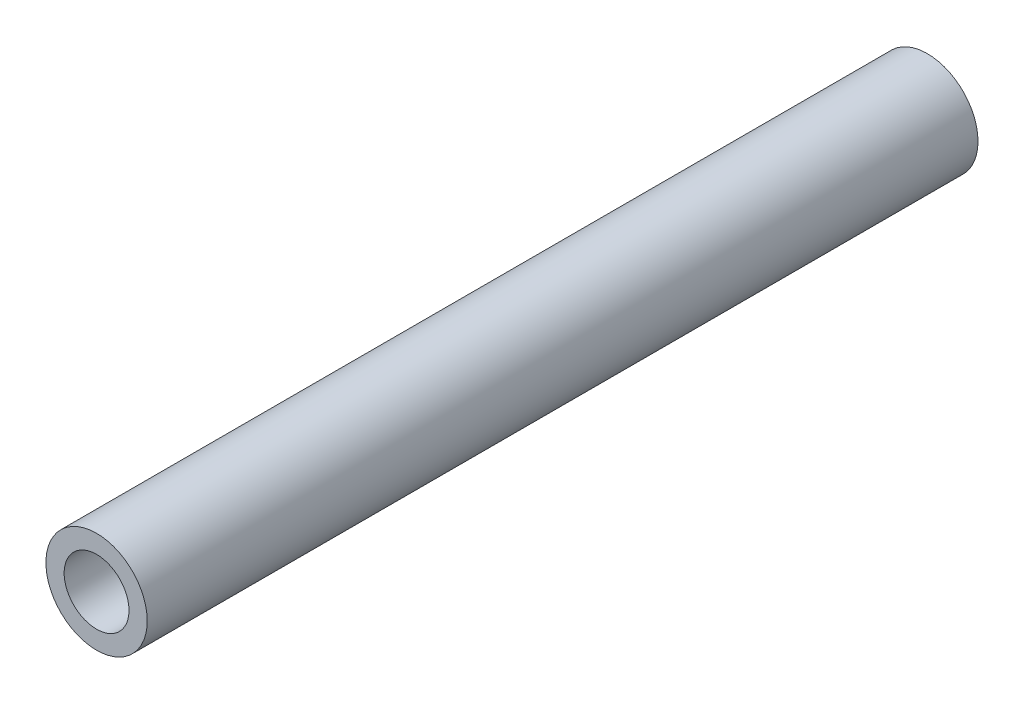
ISO-10303-21;
HEADER;
FILE_DESCRIPTION(('STEP AP214'),'2;1');
FILE_NAME('part.step','',(''),(''),'','','');
FILE_SCHEMA(('AUTOMOTIVE_DESIGN { 1 0 10303 214 1 1 1 1 }'));
ENDSEC;
DATA;
#1=APPLICATION_CONTEXT('core data for automotive mechanical design processes');
#2=APPLICATION_PROTOCOL_DEFINITION('international standard','automotive_design',2000,#1);
#3=PRODUCT_CONTEXT('',#1,'mechanical');
#4=PRODUCT('Part','Part','',(#3));
#5=PRODUCT_RELATED_PRODUCT_CATEGORY('part','',(#4));
#6=PRODUCT_DEFINITION_FORMATION('','',#4);
#7=PRODUCT_DEFINITION_CONTEXT('part definition',#1,'design');
#8=PRODUCT_DEFINITION('design','',#6,#7);
#9=PRODUCT_DEFINITION_SHAPE('','',#8);
#10=(LENGTH_UNIT() NAMED_UNIT(*) SI_UNIT(.MILLI.,.METRE.));
#11=(NAMED_UNIT(*) PLANE_ANGLE_UNIT() SI_UNIT($,.RADIAN.));
#12=(NAMED_UNIT(*) SI_UNIT($,.STERADIAN.) SOLID_ANGLE_UNIT());
#13=UNCERTAINTY_MEASURE_WITH_UNIT(LENGTH_MEASURE(1.E-05),#10,'distance_accuracy_value','');
#14=(GEOMETRIC_REPRESENTATION_CONTEXT(3) GLOBAL_UNCERTAINTY_ASSIGNED_CONTEXT((#13)) GLOBAL_UNIT_ASSIGNED_CONTEXT((#10,
#11,#12)) REPRESENTATION_CONTEXT('',''));
#15=CARTESIAN_POINT('',(0.,0.,0.));
#16=DIRECTION('',(0.,0.,1.));
#17=DIRECTION('',(1.,0.,0.));
#18=AXIS2_PLACEMENT_3D('',#15,#16,#17);
#19=CARTESIAN_POINT('',(0.,0.,41.));
#20=DIRECTION('',(0.,0.,1.));
#21=DIRECTION('',(1.,0.,0.));
#22=AXIS2_PLACEMENT_3D('',#19,#20,#21);
#23=PLANE('',#22);
#24=CARTESIAN_POINT('',(0.,0.,41.));
#25=DIRECTION('',(0.,0.,1.));
#26=DIRECTION('',(1.,0.,0.));
#27=AXIS2_PLACEMENT_3D('',#24,#25,#26);
#28=CIRCLE('',#27,2.5);
#29=CARTESIAN_POINT('',(2.5,0.,41.));
#30=VERTEX_POINT('',#29);
#31=EDGE_CURVE('E10',#30,#30,#28,.T.);
#32=ORIENTED_EDGE('',*,*,#31,.T.);
#33=EDGE_LOOP('',(#32));
#34=FACE_BOUND('',#33,.T.);
#35=CARTESIAN_POINT('',(0.,0.,41.));
#36=DIRECTION('',(0.,0.,1.));
#37=DIRECTION('',(1.,0.,0.));
#38=AXIS2_PLACEMENT_3D('',#35,#36,#37);
#39=CIRCLE('',#38,1.6);
#40=CARTESIAN_POINT('',(1.6,0.,41.));
#41=VERTEX_POINT('',#40);
#42=EDGE_CURVE('E42',#41,#41,#39,.T.);
#43=ORIENTED_EDGE('',*,*,#42,.F.);
#44=EDGE_LOOP('',(#43));
#45=FACE_BOUND('',#44,.T.);
#46=ADVANCED_FACE('F31',(#34,#45),#23,.T.);
#47=CARTESIAN_POINT('',(0.,0.,0.));
#48=DIRECTION('',(0.,0.,1.));
#49=DIRECTION('',(1.,0.,0.));
#50=AXIS2_PLACEMENT_3D('',#47,#48,#49);
#51=PLANE('',#50);
#52=CARTESIAN_POINT('',(0.,0.,0.));
#53=DIRECTION('',(0.,0.,1.));
#54=DIRECTION('',(1.,0.,0.));
#55=AXIS2_PLACEMENT_3D('',#52,#53,#54);
#56=CIRCLE('',#55,2.5);
#57=CARTESIAN_POINT('',(2.5,0.,0.));
#58=VERTEX_POINT('',#57);
#59=EDGE_CURVE('E35',#58,#58,#56,.T.);
#60=ORIENTED_EDGE('',*,*,#59,.F.);
#61=EDGE_LOOP('',(#60));
#62=FACE_BOUND('',#61,.T.);
#63=CARTESIAN_POINT('',(0.,0.,0.));
#64=DIRECTION('',(0.,0.,1.));
#65=DIRECTION('',(1.,0.,0.));
#66=AXIS2_PLACEMENT_3D('',#63,#64,#65);
#67=CIRCLE('',#66,1.6);
#68=CARTESIAN_POINT('',(1.6,0.,0.));
#69=VERTEX_POINT('',#68);
#70=EDGE_CURVE('E44',#69,#69,#67,.T.);
#71=ORIENTED_EDGE('',*,*,#70,.T.);
#72=EDGE_LOOP('',(#71));
#73=FACE_BOUND('',#72,.T.);
#74=ADVANCED_FACE('F54',(#62,#73),#51,.F.);
#75=CARTESIAN_POINT('',(0.,0.,41.));
#76=DIRECTION('',(0.,0.,-1.));
#77=DIRECTION('',(-1.,0.,0.));
#78=AXIS2_PLACEMENT_3D('',#75,#76,#77);
#79=CYLINDRICAL_SURFACE('',#78,2.5);
#80=ORIENTED_EDGE('',*,*,#31,.F.);
#81=EDGE_LOOP('',(#80));
#82=FACE_BOUND('',#81,.T.);
#83=ORIENTED_EDGE('',*,*,#59,.T.);
#84=EDGE_LOOP('',(#83));
#85=FACE_BOUND('',#84,.T.);
#86=ADVANCED_FACE('F33',(#82,#85),#79,.T.);
#87=CARTESIAN_POINT('',(0.,0.,41.));
#88=DIRECTION('',(0.,0.,-1.));
#89=DIRECTION('',(-1.,0.,0.));
#90=AXIS2_PLACEMENT_3D('',#87,#88,#89);
#91=CYLINDRICAL_SURFACE('',#90,1.6);
#92=ORIENTED_EDGE('',*,*,#42,.T.);
#93=EDGE_LOOP('',(#92));
#94=FACE_BOUND('',#93,.T.);
#95=ORIENTED_EDGE('',*,*,#70,.F.);
#96=EDGE_LOOP('',(#95));
#97=FACE_BOUND('',#96,.T.);
#98=ADVANCED_FACE('F50',(#94,#97),#91,.F.);
#99=CLOSED_SHELL('',(#46,#74,#86,#98));
#100=MANIFOLD_SOLID_BREP('B2',#99);
#101=ADVANCED_BREP_SHAPE_REPRESENTATION('',(#18,#100),#14);
#102=SHAPE_DEFINITION_REPRESENTATION(#9,#101);
ENDSEC;
END-ISO-10303-21;
